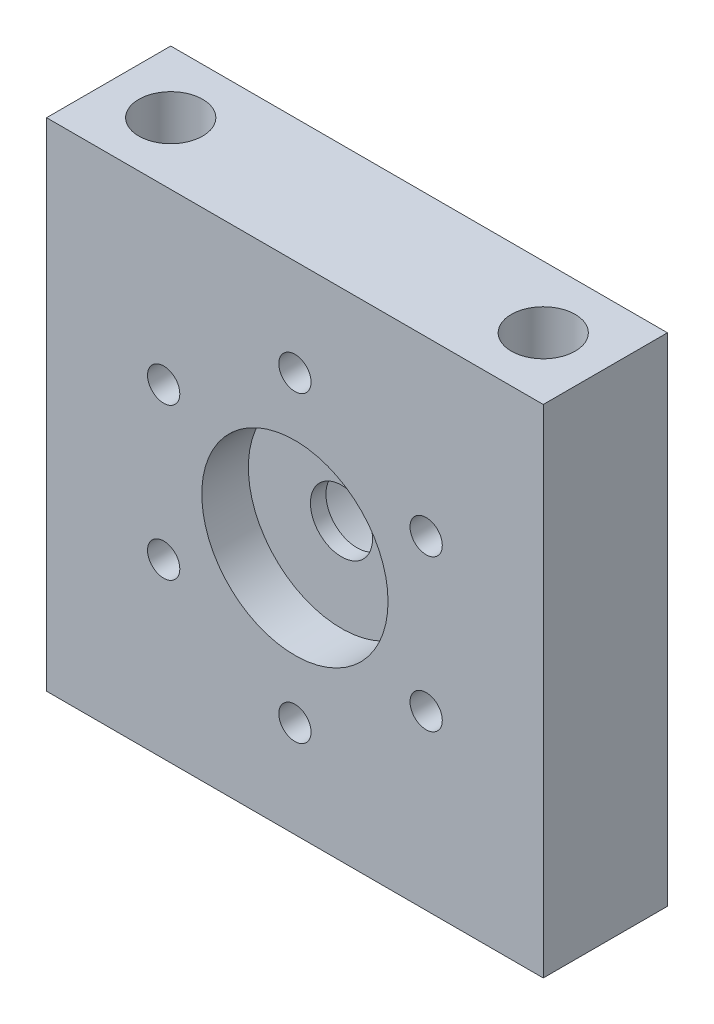
ISO-10303-21;
HEADER;
FILE_DESCRIPTION(('STEP AP214'),'2;1');
FILE_NAME('part.step','',(''),(''),'','','');
FILE_SCHEMA(('AUTOMOTIVE_DESIGN { 1 0 10303 214 1 1 1 1 }'));
ENDSEC;
DATA;
#1=APPLICATION_CONTEXT('core data for automotive mechanical design processes');
#2=APPLICATION_PROTOCOL_DEFINITION('international standard','automotive_design',2000,#1);
#3=PRODUCT_CONTEXT('',#1,'mechanical');
#4=PRODUCT('Part','Part','',(#3));
#5=PRODUCT_RELATED_PRODUCT_CATEGORY('part','',(#4));
#6=PRODUCT_DEFINITION_FORMATION('','',#4);
#7=PRODUCT_DEFINITION_CONTEXT('part definition',#1,'design');
#8=PRODUCT_DEFINITION('design','',#6,#7);
#9=PRODUCT_DEFINITION_SHAPE('','',#8);
#10=(LENGTH_UNIT() NAMED_UNIT(*) SI_UNIT(.MILLI.,.METRE.));
#11=(NAMED_UNIT(*) PLANE_ANGLE_UNIT() SI_UNIT($,.RADIAN.));
#12=(NAMED_UNIT(*) SI_UNIT($,.STERADIAN.) SOLID_ANGLE_UNIT());
#13=UNCERTAINTY_MEASURE_WITH_UNIT(LENGTH_MEASURE(1.E-05),#10,'distance_accuracy_value','');
#14=(GEOMETRIC_REPRESENTATION_CONTEXT(3) GLOBAL_UNCERTAINTY_ASSIGNED_CONTEXT((#13)) GLOBAL_UNIT_ASSIGNED_CONTEXT((#10,
#11,#12)) REPRESENTATION_CONTEXT('',''));
#15=CARTESIAN_POINT('',(0.,0.,0.));
#16=DIRECTION('',(0.,0.,1.));
#17=DIRECTION('',(1.,0.,0.));
#18=AXIS2_PLACEMENT_3D('',#15,#16,#17);
#19=CARTESIAN_POINT('',(25.4,25.4,-12.7));
#20=DIRECTION('',(0.,0.,1.));
#21=DIRECTION('',(1.,0.,0.));
#22=AXIS2_PLACEMENT_3D('',#19,#20,#21);
#23=CYLINDRICAL_SURFACE('',#22,3.175);
#24=CARTESIAN_POINT('',(25.4,25.4,-4.7625));
#25=DIRECTION('',(0.,0.,1.));
#26=DIRECTION('',(1.,0.,0.));
#27=AXIS2_PLACEMENT_3D('',#24,#25,#26);
#28=CIRCLE('',#27,3.175);
#29=CARTESIAN_POINT('',(28.575,25.4,-4.7625));
#30=VERTEX_POINT('',#29);
#31=EDGE_CURVE('E107',#30,#30,#28,.F.);
#32=ORIENTED_EDGE('',*,*,#31,.F.);
#33=EDGE_LOOP('',(#32));
#34=FACE_BOUND('',#33,.T.);
#35=CARTESIAN_POINT('',(25.4,25.4,-6.35));
#36=DIRECTION('',(0.,0.,-1.));
#37=DIRECTION('',(-1.,0.,0.));
#38=AXIS2_PLACEMENT_3D('',#35,#36,#37);
#39=CIRCLE('',#38,3.175);
#40=CARTESIAN_POINT('',(22.225,25.4,-6.35));
#41=VERTEX_POINT('',#40);
#42=EDGE_CURVE('E41',#41,#41,#39,.F.);
#43=ORIENTED_EDGE('',*,*,#42,.F.);
#44=EDGE_LOOP('',(#43));
#45=FACE_BOUND('',#44,.T.);
#46=ADVANCED_FACE('F37',(#34,#45),#23,.F.);
#47=CARTESIAN_POINT('',(0.,50.8,0.));
#48=DIRECTION('',(1.,0.,0.));
#49=DIRECTION('',(0.,0.,-1.));
#50=AXIS2_PLACEMENT_3D('',#47,#48,#49);
#51=PLANE('',#50);
#52=DIRECTION('',(0.,0.,1.));
#53=VECTOR('',#52,1.);
#54=CARTESIAN_POINT('',(0.,0.,0.));
#55=LINE('',#54,#53);
#56=CARTESIAN_POINT('',(0.,0.,-12.7));
#57=VERTEX_POINT('',#56);
#58=CARTESIAN_POINT('',(0.,0.,0.));
#59=VERTEX_POINT('',#58);
#60=EDGE_CURVE('E104',#57,#59,#55,.T.);
#61=ORIENTED_EDGE('',*,*,#60,.T.);
#62=DIRECTION('',(0.,-1.,0.));
#63=VECTOR('',#62,1.);
#64=CARTESIAN_POINT('',(0.,50.8,0.));
#65=LINE('',#64,#63);
#66=CARTESIAN_POINT('',(0.,50.8,0.));
#67=VERTEX_POINT('',#66);
#68=EDGE_CURVE('E11',#67,#59,#65,.T.);
#69=ORIENTED_EDGE('',*,*,#68,.F.);
#70=DIRECTION('',(0.,0.,1.));
#71=VECTOR('',#70,1.);
#72=CARTESIAN_POINT('',(0.,50.8,0.));
#73=LINE('',#72,#71);
#74=CARTESIAN_POINT('',(0.,50.8,-12.7));
#75=VERTEX_POINT('',#74);
#76=EDGE_CURVE('E91',#75,#67,#73,.T.);
#77=ORIENTED_EDGE('',*,*,#76,.F.);
#78=DIRECTION('',(0.,-1.,0.));
#79=VECTOR('',#78,1.);
#80=CARTESIAN_POINT('',(0.,50.8,-12.7));
#81=LINE('',#80,#79);
#82=EDGE_CURVE('E100',#75,#57,#81,.T.);
#83=ORIENTED_EDGE('',*,*,#82,.T.);
#84=EDGE_LOOP('',(#61,#69,#77,#83));
#85=FACE_BOUND('',#84,.T.);
#86=ADVANCED_FACE('F39',(#85),#51,.F.);
#87=CARTESIAN_POINT('',(0.,50.8,0.));
#88=DIRECTION('',(0.,0.,-1.));
#89=DIRECTION('',(-1.,0.,0.));
#90=AXIS2_PLACEMENT_3D('',#87,#88,#89);
#91=PLANE('',#90);
#92=CARTESIAN_POINT('',(25.4,40.9,0.));
#93=DIRECTION('',(0.,0.,1.));
#94=DIRECTION('',(1.,0.,0.));
#95=AXIS2_PLACEMENT_3D('',#92,#93,#94);
#96=CIRCLE('',#95,1.65);
#97=CARTESIAN_POINT('',(27.05,40.9,0.));
#98=VERTEX_POINT('',#97);
#99=EDGE_CURVE('E174',#98,#98,#96,.T.);
#100=ORIENTED_EDGE('',*,*,#99,.F.);
#101=EDGE_LOOP('',(#100));
#102=FACE_BOUND('',#101,.T.);
#103=CARTESIAN_POINT('',(11.9766062413417,33.1499999999994,0.));
#104=DIRECTION('',(0.,0.,1.));
#105=DIRECTION('',(1.,0.,0.));
#106=AXIS2_PLACEMENT_3D('',#103,#104,#105);
#107=CIRCLE('',#106,1.65);
#108=CARTESIAN_POINT('',(13.6266062413417,33.1499999999994,0.));
#109=VERTEX_POINT('',#108);
#110=EDGE_CURVE('E153',#109,#109,#107,.T.);
#111=ORIENTED_EDGE('',*,*,#110,.F.);
#112=EDGE_LOOP('',(#111));
#113=FACE_BOUND('',#112,.T.);
#114=CARTESIAN_POINT('',(11.9766062413424,17.6499999999994,0.));
#115=DIRECTION('',(0.,0.,1.));
#116=DIRECTION('',(1.,0.,0.));
#117=AXIS2_PLACEMENT_3D('',#114,#115,#116);
#118=CIRCLE('',#117,1.65);
#119=CARTESIAN_POINT('',(13.6266062413424,17.6499999999994,0.));
#120=VERTEX_POINT('',#119);
#121=EDGE_CURVE('E152',#120,#120,#118,.T.);
#122=ORIENTED_EDGE('',*,*,#121,.F.);
#123=EDGE_LOOP('',(#122));
#124=FACE_BOUND('',#123,.T.);
#125=CARTESIAN_POINT('',(25.4000000000017,9.9,0.));
#126=DIRECTION('',(0.,0.,1.));
#127=DIRECTION('',(1.,0.,0.));
#128=AXIS2_PLACEMENT_3D('',#125,#126,#127);
#129=CIRCLE('',#128,1.65);
#130=CARTESIAN_POINT('',(27.0500000000017,9.9,0.));
#131=VERTEX_POINT('',#130);
#132=EDGE_CURVE('E159',#131,#131,#129,.T.);
#133=ORIENTED_EDGE('',*,*,#132,.F.);
#134=EDGE_LOOP('',(#133));
#135=FACE_BOUND('',#134,.T.);
#136=CARTESIAN_POINT('',(38.8233937586601,17.6500000000007,0.));
#137=DIRECTION('',(0.,0.,1.));
#138=DIRECTION('',(1.,0.,0.));
#139=AXIS2_PLACEMENT_3D('',#136,#137,#138);
#140=CIRCLE('',#139,1.65);
#141=CARTESIAN_POINT('',(40.4733937586601,17.6500000000007,0.));
#142=VERTEX_POINT('',#141);
#143=EDGE_CURVE('E165',#142,#142,#140,.T.);
#144=ORIENTED_EDGE('',*,*,#143,.F.);
#145=EDGE_LOOP('',(#144));
#146=FACE_BOUND('',#145,.T.);
#147=CARTESIAN_POINT('',(38.8233937586593,33.1500000000007,0.));
#148=DIRECTION('',(0.,0.,1.));
#149=DIRECTION('',(1.,0.,0.));
#150=AXIS2_PLACEMENT_3D('',#147,#148,#149);
#151=CIRCLE('',#150,1.65);
#152=CARTESIAN_POINT('',(40.4733937586593,33.1500000000007,0.));
#153=VERTEX_POINT('',#152);
#154=EDGE_CURVE('E171',#153,#153,#151,.T.);
#155=ORIENTED_EDGE('',*,*,#154,.F.);
#156=EDGE_LOOP('',(#155));
#157=FACE_BOUND('',#156,.T.);
#158=CARTESIAN_POINT('',(25.4,25.4,0.));
#159=DIRECTION('',(0.,0.,1.));
#160=DIRECTION('',(1.,0.,0.));
#161=AXIS2_PLACEMENT_3D('',#158,#159,#160);
#162=CIRCLE('',#161,9.525);
#163=CARTESIAN_POINT('',(34.925,25.4,0.));
#164=VERTEX_POINT('',#163);
#165=EDGE_CURVE('E117',#164,#164,#162,.T.);
#166=ORIENTED_EDGE('',*,*,#165,.F.);
#167=EDGE_LOOP('',(#166));
#168=FACE_BOUND('',#167,.T.);
#169=DIRECTION('',(1.,0.,0.));
#170=VECTOR('',#169,1.);
#171=CARTESIAN_POINT('',(0.,0.,0.));
#172=LINE('',#171,#170);
#173=CARTESIAN_POINT('',(50.8,0.,0.));
#174=VERTEX_POINT('',#173);
#175=EDGE_CURVE('E95',#59,#174,#172,.T.);
#176=ORIENTED_EDGE('',*,*,#175,.T.);
#177=DIRECTION('',(0.,-1.,0.));
#178=VECTOR('',#177,1.);
#179=CARTESIAN_POINT('',(50.8,50.8,0.));
#180=LINE('',#179,#178);
#181=CARTESIAN_POINT('',(50.8,50.8,0.));
#182=VERTEX_POINT('',#181);
#183=EDGE_CURVE('E47',#182,#174,#180,.T.);
#184=ORIENTED_EDGE('',*,*,#183,.F.);
#185=DIRECTION('',(1.,0.,0.));
#186=VECTOR('',#185,1.);
#187=CARTESIAN_POINT('',(0.,50.8,0.));
#188=LINE('',#187,#186);
#189=EDGE_CURVE('E86',#67,#182,#188,.T.);
#190=ORIENTED_EDGE('',*,*,#189,.F.);
#191=ORIENTED_EDGE('',*,*,#68,.T.);
#192=EDGE_LOOP('',(#176,#184,#190,#191));
#193=FACE_BOUND('',#192,.T.);
#194=ADVANCED_FACE('F94',(#102,#113,#124,#135,#146,#157,#168,#193),#91,.F.);
#195=CARTESIAN_POINT('',(50.8,50.8,0.));
#196=DIRECTION('',(-1.,0.,0.));
#197=DIRECTION('',(0.,0.,1.));
#198=AXIS2_PLACEMENT_3D('',#195,#196,#197);
#199=PLANE('',#198);
#200=DIRECTION('',(0.,0.,-1.));
#201=VECTOR('',#200,1.);
#202=CARTESIAN_POINT('',(50.8,0.,0.));
#203=LINE('',#202,#201);
#204=CARTESIAN_POINT('',(50.8,0.,-12.7));
#205=VERTEX_POINT('',#204);
#206=EDGE_CURVE('E73',#174,#205,#203,.T.);
#207=ORIENTED_EDGE('',*,*,#206,.T.);
#208=DIRECTION('',(0.,-1.,0.));
#209=VECTOR('',#208,1.);
#210=CARTESIAN_POINT('',(50.8,50.8,-12.7));
#211=LINE('',#210,#209);
#212=CARTESIAN_POINT('',(50.8,50.8,-12.7));
#213=VERTEX_POINT('',#212);
#214=EDGE_CURVE('E96',#213,#205,#211,.T.);
#215=ORIENTED_EDGE('',*,*,#214,.F.);
#216=DIRECTION('',(0.,0.,-1.));
#217=VECTOR('',#216,1.);
#218=CARTESIAN_POINT('',(50.8,50.8,0.));
#219=LINE('',#218,#217);
#220=EDGE_CURVE('E89',#182,#213,#219,.T.);
#221=ORIENTED_EDGE('',*,*,#220,.F.);
#222=ORIENTED_EDGE('',*,*,#183,.T.);
#223=EDGE_LOOP('',(#207,#215,#221,#222));
#224=FACE_BOUND('',#223,.T.);
#225=ADVANCED_FACE('F98',(#224),#199,.F.);
#226=CARTESIAN_POINT('',(0.,50.8,-12.7));
#227=DIRECTION('',(0.,0.,1.));
#228=DIRECTION('',(1.,0.,0.));
#229=AXIS2_PLACEMENT_3D('',#226,#227,#228);
#230=PLANE('',#229);
#231=CARTESIAN_POINT('',(25.4,25.4,-12.7));
#232=DIRECTION('',(0.,0.,-1.));
#233=DIRECTION('',(-1.,0.,0.));
#234=AXIS2_PLACEMENT_3D('',#231,#232,#233);
#235=CIRCLE('',#234,7.62);
#236=CARTESIAN_POINT('',(17.78,25.4,-12.7));
#237=VERTEX_POINT('',#236);
#238=EDGE_CURVE('E184',#237,#237,#235,.T.);
#239=ORIENTED_EDGE('',*,*,#238,.F.);
#240=EDGE_LOOP('',(#239));
#241=FACE_BOUND('',#240,.T.);
#242=CARTESIAN_POINT('',(25.4,40.9,-12.7));
#243=DIRECTION('',(0.,0.,1.));
#244=DIRECTION('',(1.,0.,0.));
#245=AXIS2_PLACEMENT_3D('',#242,#243,#244);
#246=CIRCLE('',#245,1.65);
#247=CARTESIAN_POINT('',(27.05,40.9,-12.7));
#248=VERTEX_POINT('',#247);
#249=EDGE_CURVE('E141',#248,#248,#246,.T.);
#250=ORIENTED_EDGE('',*,*,#249,.T.);
#251=EDGE_LOOP('',(#250));
#252=FACE_BOUND('',#251,.T.);
#253=CARTESIAN_POINT('',(11.9766062413417,33.1499999999994,-12.7));
#254=DIRECTION('',(0.,0.,1.));
#255=DIRECTION('',(1.,0.,0.));
#256=AXIS2_PLACEMENT_3D('',#253,#254,#255);
#257=CIRCLE('',#256,1.65);
#258=CARTESIAN_POINT('',(13.6266062413417,33.1499999999994,-12.7));
#259=VERTEX_POINT('',#258);
#260=EDGE_CURVE('E175',#259,#259,#257,.T.);
#261=ORIENTED_EDGE('',*,*,#260,.T.);
#262=EDGE_LOOP('',(#261));
#263=FACE_BOUND('',#262,.T.);
#264=CARTESIAN_POINT('',(11.9766062413424,17.6499999999994,-12.7));
#265=DIRECTION('',(0.,0.,1.));
#266=DIRECTION('',(1.,0.,0.));
#267=AXIS2_PLACEMENT_3D('',#264,#265,#266);
#268=CIRCLE('',#267,1.65);
#269=CARTESIAN_POINT('',(13.6266062413424,17.6499999999994,-12.7));
#270=VERTEX_POINT('',#269);
#271=EDGE_CURVE('E149',#270,#270,#268,.T.);
#272=ORIENTED_EDGE('',*,*,#271,.T.);
#273=EDGE_LOOP('',(#272));
#274=FACE_BOUND('',#273,.T.);
#275=CARTESIAN_POINT('',(25.4000000000017,9.9,-12.7));
#276=DIRECTION('',(0.,0.,1.));
#277=DIRECTION('',(1.,0.,0.));
#278=AXIS2_PLACEMENT_3D('',#275,#276,#277);
#279=CIRCLE('',#278,1.65);
#280=CARTESIAN_POINT('',(27.0500000000017,9.9,-12.7));
#281=VERTEX_POINT('',#280);
#282=EDGE_CURVE('E156',#281,#281,#279,.T.);
#283=ORIENTED_EDGE('',*,*,#282,.T.);
#284=EDGE_LOOP('',(#283));
#285=FACE_BOUND('',#284,.T.);
#286=CARTESIAN_POINT('',(38.8233937586601,17.6500000000007,-12.7));
#287=DIRECTION('',(0.,0.,1.));
#288=DIRECTION('',(1.,0.,0.));
#289=AXIS2_PLACEMENT_3D('',#286,#287,#288);
#290=CIRCLE('',#289,1.65);
#291=CARTESIAN_POINT('',(40.4733937586601,17.6500000000007,-12.7));
#292=VERTEX_POINT('',#291);
#293=EDGE_CURVE('E162',#292,#292,#290,.T.);
#294=ORIENTED_EDGE('',*,*,#293,.T.);
#295=EDGE_LOOP('',(#294));
#296=FACE_BOUND('',#295,.T.);
#297=CARTESIAN_POINT('',(38.8233937586593,33.1500000000007,-12.7));
#298=DIRECTION('',(0.,0.,1.));
#299=DIRECTION('',(1.,0.,0.));
#300=AXIS2_PLACEMENT_3D('',#297,#298,#299);
#301=CIRCLE('',#300,1.65);
#302=CARTESIAN_POINT('',(40.4733937586593,33.1500000000007,-12.7));
#303=VERTEX_POINT('',#302);
#304=EDGE_CURVE('E168',#303,#303,#301,.T.);
#305=ORIENTED_EDGE('',*,*,#304,.T.);
#306=EDGE_LOOP('',(#305));
#307=FACE_BOUND('',#306,.T.);
#308=DIRECTION('',(-1.,0.,0.));
#309=VECTOR('',#308,1.);
#310=CARTESIAN_POINT('',(0.,0.,-12.7));
#311=LINE('',#310,#309);
#312=EDGE_CURVE('E79',#205,#57,#311,.T.);
#313=ORIENTED_EDGE('',*,*,#312,.T.);
#314=ORIENTED_EDGE('',*,*,#82,.F.);
#315=DIRECTION('',(-1.,0.,0.));
#316=VECTOR('',#315,1.);
#317=CARTESIAN_POINT('',(0.,50.8,-12.7));
#318=LINE('',#317,#316);
#319=EDGE_CURVE('E56',#213,#75,#318,.T.);
#320=ORIENTED_EDGE('',*,*,#319,.F.);
#321=ORIENTED_EDGE('',*,*,#214,.T.);
#322=EDGE_LOOP('',(#313,#314,#320,#321));
#323=FACE_BOUND('',#322,.T.);
#324=ADVANCED_FACE('F210',(#241,#252,#263,#274,#285,#296,#307,#323),#230,.F.);
#325=CARTESIAN_POINT('',(0.,50.8,0.));
#326=DIRECTION('',(0.,-1.,0.));
#327=DIRECTION('',(0.,0.,-1.));
#328=AXIS2_PLACEMENT_3D('',#325,#326,#327);
#329=PLANE('',#328);
#330=CARTESIAN_POINT('',(6.35,50.8,-6.35));
#331=DIRECTION('',(0.,1.,0.));
#332=DIRECTION('',(0.,0.,1.));
#333=AXIS2_PLACEMENT_3D('',#330,#331,#332);
#334=CIRCLE('',#333,3.2639);
#335=CARTESIAN_POINT('',(6.35,50.8,-3.08609999999999));
#336=VERTEX_POINT('',#335);
#337=EDGE_CURVE('E132',#336,#336,#334,.T.);
#338=ORIENTED_EDGE('',*,*,#337,.F.);
#339=EDGE_LOOP('',(#338));
#340=FACE_BOUND('',#339,.T.);
#341=CARTESIAN_POINT('',(44.45,50.8,-6.35));
#342=DIRECTION('',(0.,1.,0.));
#343=DIRECTION('',(0.,0.,1.));
#344=AXIS2_PLACEMENT_3D('',#341,#342,#343);
#345=CIRCLE('',#344,3.26389999999999);
#346=CARTESIAN_POINT('',(44.45,50.8,-3.08610000000001));
#347=VERTEX_POINT('',#346);
#348=EDGE_CURVE('E128',#347,#347,#345,.T.);
#349=ORIENTED_EDGE('',*,*,#348,.F.);
#350=EDGE_LOOP('',(#349));
#351=FACE_BOUND('',#350,.T.);
#352=ORIENTED_EDGE('',*,*,#76,.T.);
#353=ORIENTED_EDGE('',*,*,#189,.T.);
#354=ORIENTED_EDGE('',*,*,#220,.T.);
#355=ORIENTED_EDGE('',*,*,#319,.T.);
#356=EDGE_LOOP('',(#352,#353,#354,#355));
#357=FACE_BOUND('',#356,.T.);
#358=ADVANCED_FACE('F87',(#340,#351,#357),#329,.F.);
#359=CARTESIAN_POINT('',(0.,0.,0.));
#360=DIRECTION('',(0.,-1.,0.));
#361=DIRECTION('',(0.,0.,-1.));
#362=AXIS2_PLACEMENT_3D('',#359,#360,#361);
#363=PLANE('',#362);
#364=CARTESIAN_POINT('',(6.35,0.,-6.35));
#365=DIRECTION('',(0.,1.,0.));
#366=DIRECTION('',(0.,0.,1.));
#367=AXIS2_PLACEMENT_3D('',#364,#365,#366);
#368=CIRCLE('',#367,3.2639);
#369=CARTESIAN_POINT('',(6.35,0.,-3.08609999999999));
#370=VERTEX_POINT('',#369);
#371=EDGE_CURVE('E144',#370,#370,#368,.T.);
#372=ORIENTED_EDGE('',*,*,#371,.T.);
#373=EDGE_LOOP('',(#372));
#374=FACE_BOUND('',#373,.T.);
#375=CARTESIAN_POINT('',(44.45,0.,-6.35));
#376=DIRECTION('',(0.,1.,0.));
#377=DIRECTION('',(0.,0.,1.));
#378=AXIS2_PLACEMENT_3D('',#375,#376,#377);
#379=CIRCLE('',#378,3.26389999999999);
#380=CARTESIAN_POINT('',(44.45,0.,-3.08610000000001));
#381=VERTEX_POINT('',#380);
#382=EDGE_CURVE('E137',#381,#381,#379,.T.);
#383=ORIENTED_EDGE('',*,*,#382,.T.);
#384=EDGE_LOOP('',(#383));
#385=FACE_BOUND('',#384,.T.);
#386=ORIENTED_EDGE('',*,*,#60,.F.);
#387=ORIENTED_EDGE('',*,*,#312,.F.);
#388=ORIENTED_EDGE('',*,*,#206,.F.);
#389=ORIENTED_EDGE('',*,*,#175,.F.);
#390=EDGE_LOOP('',(#386,#387,#388,#389));
#391=FACE_BOUND('',#390,.T.);
#392=ADVANCED_FACE('F209',(#374,#385,#391),#363,.T.);
#393=CARTESIAN_POINT('',(25.4,25.4,-4.7625));
#394=DIRECTION('',(0.,0.,1.));
#395=DIRECTION('',(1.,0.,0.));
#396=AXIS2_PLACEMENT_3D('',#393,#394,#395);
#397=PLANE('',#396);
#398=CARTESIAN_POINT('',(25.4,25.4,-4.7625));
#399=DIRECTION('',(0.,0.,1.));
#400=DIRECTION('',(1.,0.,0.));
#401=AXIS2_PLACEMENT_3D('',#398,#399,#400);
#402=CIRCLE('',#401,9.525);
#403=CARTESIAN_POINT('',(34.925,25.4,-4.7625));
#404=VERTEX_POINT('',#403);
#405=EDGE_CURVE('E113',#404,#404,#402,.T.);
#406=ORIENTED_EDGE('',*,*,#405,.T.);
#407=EDGE_LOOP('',(#406));
#408=FACE_BOUND('',#407,.T.);
#409=ORIENTED_EDGE('',*,*,#31,.T.);
#410=EDGE_LOOP('',(#409));
#411=FACE_BOUND('',#410,.T.);
#412=ADVANCED_FACE('F214',(#408,#411),#397,.T.);
#413=CARTESIAN_POINT('',(25.4,25.4,-4.7625));
#414=DIRECTION('',(0.,0.,1.));
#415=DIRECTION('',(1.,0.,0.));
#416=AXIS2_PLACEMENT_3D('',#413,#414,#415);
#417=CYLINDRICAL_SURFACE('',#416,9.525);
#418=ORIENTED_EDGE('',*,*,#405,.F.);
#419=EDGE_LOOP('',(#418));
#420=FACE_BOUND('',#419,.T.);
#421=ORIENTED_EDGE('',*,*,#165,.T.);
#422=EDGE_LOOP('',(#421));
#423=FACE_BOUND('',#422,.T.);
#424=ADVANCED_FACE('F205',(#420,#423),#417,.F.);
#425=CARTESIAN_POINT('',(44.45,38.1,-6.35));
#426=DIRECTION('',(0.,1.,0.));
#427=DIRECTION('',(0.,0.,1.));
#428=AXIS2_PLACEMENT_3D('',#425,#426,#427);
#429=CYLINDRICAL_SURFACE('',#428,3.26389999999999);
#430=CARTESIAN_POINT('',(44.45,38.1,-6.35));
#431=DIRECTION('',(0.,1.,0.));
#432=DIRECTION('',(0.,0.,1.));
#433=AXIS2_PLACEMENT_3D('',#430,#431,#432);
#434=CIRCLE('',#433,3.26389999999999);
#435=CARTESIAN_POINT('',(44.45,38.1,-3.08610000000001));
#436=VERTEX_POINT('',#435);
#437=EDGE_CURVE('E125',#436,#436,#434,.T.);
#438=ORIENTED_EDGE('',*,*,#437,.F.);
#439=EDGE_LOOP('',(#438));
#440=FACE_BOUND('',#439,.T.);
#441=ORIENTED_EDGE('',*,*,#348,.T.);
#442=EDGE_LOOP('',(#441));
#443=FACE_BOUND('',#442,.T.);
#444=ADVANCED_FACE('F239',(#440,#443),#429,.F.);
#445=CARTESIAN_POINT('',(44.45,38.1,-6.35));
#446=DIRECTION('',(0.,1.,0.));
#447=DIRECTION('',(0.,0.,1.));
#448=AXIS2_PLACEMENT_3D('',#445,#446,#447);
#449=PLANE('',#448);
#450=ORIENTED_EDGE('',*,*,#437,.T.);
#451=EDGE_LOOP('',(#450));
#452=FACE_BOUND('',#451,.T.);
#453=ADVANCED_FACE('F245',(#452),#449,.T.);
#454=CARTESIAN_POINT('',(6.35,38.1,-6.35));
#455=DIRECTION('',(0.,1.,0.));
#456=DIRECTION('',(0.,0.,1.));
#457=AXIS2_PLACEMENT_3D('',#454,#455,#456);
#458=CYLINDRICAL_SURFACE('',#457,3.2639);
#459=CARTESIAN_POINT('',(6.35,38.1,-6.35));
#460=DIRECTION('',(0.,1.,0.));
#461=DIRECTION('',(0.,0.,1.));
#462=AXIS2_PLACEMENT_3D('',#459,#460,#461);
#463=CIRCLE('',#462,3.2639);
#464=CARTESIAN_POINT('',(6.35,38.1,-3.08609999999999));
#465=VERTEX_POINT('',#464);
#466=EDGE_CURVE('E122',#465,#465,#463,.T.);
#467=ORIENTED_EDGE('',*,*,#466,.F.);
#468=EDGE_LOOP('',(#467));
#469=FACE_BOUND('',#468,.T.);
#470=ORIENTED_EDGE('',*,*,#337,.T.);
#471=EDGE_LOOP('',(#470));
#472=FACE_BOUND('',#471,.T.);
#473=ADVANCED_FACE('F252',(#469,#472),#458,.F.);
#474=CARTESIAN_POINT('',(6.35,38.1,-6.35));
#475=DIRECTION('',(0.,1.,0.));
#476=DIRECTION('',(0.,0.,1.));
#477=AXIS2_PLACEMENT_3D('',#474,#475,#476);
#478=PLANE('',#477);
#479=ORIENTED_EDGE('',*,*,#466,.T.);
#480=EDGE_LOOP('',(#479));
#481=FACE_BOUND('',#480,.T.);
#482=ADVANCED_FACE('F257',(#481),#478,.T.);
#483=CARTESIAN_POINT('',(44.45,12.7,-6.35));
#484=DIRECTION('',(0.,-1.,0.));
#485=DIRECTION('',(0.,0.,-1.));
#486=AXIS2_PLACEMENT_3D('',#483,#484,#485);
#487=CYLINDRICAL_SURFACE('',#486,3.26389999999999);
#488=CARTESIAN_POINT('',(44.45,12.7,-6.35));
#489=DIRECTION('',(0.,1.,0.));
#490=DIRECTION('',(0.,0.,1.));
#491=AXIS2_PLACEMENT_3D('',#488,#489,#490);
#492=CIRCLE('',#491,3.26389999999999);
#493=CARTESIAN_POINT('',(44.45,12.7,-3.08610000000001));
#494=VERTEX_POINT('',#493);
#495=EDGE_CURVE('E140',#494,#494,#492,.T.);
#496=ORIENTED_EDGE('',*,*,#495,.T.);
#497=EDGE_LOOP('',(#496));
#498=FACE_BOUND('',#497,.T.);
#499=ORIENTED_EDGE('',*,*,#382,.F.);
#500=EDGE_LOOP('',(#499));
#501=FACE_BOUND('',#500,.T.);
#502=ADVANCED_FACE('F261',(#498,#501),#487,.F.);
#503=CARTESIAN_POINT('',(44.45,12.7,-6.35));
#504=DIRECTION('',(0.,-1.,0.));
#505=DIRECTION('',(0.,0.,1.));
#506=AXIS2_PLACEMENT_3D('',#503,#504,#505);
#507=PLANE('',#506);
#508=ORIENTED_EDGE('',*,*,#495,.F.);
#509=EDGE_LOOP('',(#508));
#510=FACE_BOUND('',#509,.T.);
#511=ADVANCED_FACE('F265',(#510),#507,.T.);
#512=CARTESIAN_POINT('',(6.35,12.7,-6.35));
#513=DIRECTION('',(0.,-1.,0.));
#514=DIRECTION('',(0.,0.,-1.));
#515=AXIS2_PLACEMENT_3D('',#512,#513,#514);
#516=CYLINDRICAL_SURFACE('',#515,3.2639);
#517=CARTESIAN_POINT('',(6.35,12.7,-6.35));
#518=DIRECTION('',(0.,1.,0.));
#519=DIRECTION('',(0.,0.,1.));
#520=AXIS2_PLACEMENT_3D('',#517,#518,#519);
#521=CIRCLE('',#520,3.2639);
#522=CARTESIAN_POINT('',(6.35,12.7,-3.08609999999999));
#523=VERTEX_POINT('',#522);
#524=EDGE_CURVE('E129',#523,#523,#521,.T.);
#525=ORIENTED_EDGE('',*,*,#524,.T.);
#526=EDGE_LOOP('',(#525));
#527=FACE_BOUND('',#526,.T.);
#528=ORIENTED_EDGE('',*,*,#371,.F.);
#529=EDGE_LOOP('',(#528));
#530=FACE_BOUND('',#529,.T.);
#531=ADVANCED_FACE('F269',(#527,#530),#516,.F.);
#532=CARTESIAN_POINT('',(6.35,12.7,-6.35));
#533=DIRECTION('',(0.,-1.,0.));
#534=DIRECTION('',(0.,0.,1.));
#535=AXIS2_PLACEMENT_3D('',#532,#533,#534);
#536=PLANE('',#535);
#537=ORIENTED_EDGE('',*,*,#524,.F.);
#538=EDGE_LOOP('',(#537));
#539=FACE_BOUND('',#538,.T.);
#540=ADVANCED_FACE('F273',(#539),#536,.T.);
#541=CARTESIAN_POINT('',(38.8233937586593,33.1500000000007,-12.7));
#542=DIRECTION('',(0.,0.,1.));
#543=DIRECTION('',(1.,0.,0.));
#544=AXIS2_PLACEMENT_3D('',#541,#542,#543);
#545=CYLINDRICAL_SURFACE('',#544,1.65);
#546=ORIENTED_EDGE('',*,*,#304,.F.);
#547=EDGE_LOOP('',(#546));
#548=FACE_BOUND('',#547,.T.);
#549=ORIENTED_EDGE('',*,*,#154,.T.);
#550=EDGE_LOOP('',(#549));
#551=FACE_BOUND('',#550,.T.);
#552=ADVANCED_FACE('F277',(#548,#551),#545,.F.);
#553=CARTESIAN_POINT('',(38.8233937586601,17.6500000000007,-12.7));
#554=DIRECTION('',(0.,0.,1.));
#555=DIRECTION('',(1.,0.,0.));
#556=AXIS2_PLACEMENT_3D('',#553,#554,#555);
#557=CYLINDRICAL_SURFACE('',#556,1.65);
#558=ORIENTED_EDGE('',*,*,#293,.F.);
#559=EDGE_LOOP('',(#558));
#560=FACE_BOUND('',#559,.T.);
#561=ORIENTED_EDGE('',*,*,#143,.T.);
#562=EDGE_LOOP('',(#561));
#563=FACE_BOUND('',#562,.T.);
#564=ADVANCED_FACE('F287',(#560,#563),#557,.F.);
#565=CARTESIAN_POINT('',(25.4000000000017,9.9,-12.7));
#566=DIRECTION('',(0.,0.,1.));
#567=DIRECTION('',(1.,0.,0.));
#568=AXIS2_PLACEMENT_3D('',#565,#566,#567);
#569=CYLINDRICAL_SURFACE('',#568,1.65);
#570=ORIENTED_EDGE('',*,*,#282,.F.);
#571=EDGE_LOOP('',(#570));
#572=FACE_BOUND('',#571,.T.);
#573=ORIENTED_EDGE('',*,*,#132,.T.);
#574=EDGE_LOOP('',(#573));
#575=FACE_BOUND('',#574,.T.);
#576=ADVANCED_FACE('F283',(#572,#575),#569,.F.);
#577=CARTESIAN_POINT('',(11.9766062413424,17.6499999999994,-12.7));
#578=DIRECTION('',(0.,0.,1.));
#579=DIRECTION('',(1.,0.,0.));
#580=AXIS2_PLACEMENT_3D('',#577,#578,#579);
#581=CYLINDRICAL_SURFACE('',#580,1.65);
#582=ORIENTED_EDGE('',*,*,#271,.F.);
#583=EDGE_LOOP('',(#582));
#584=FACE_BOUND('',#583,.T.);
#585=ORIENTED_EDGE('',*,*,#121,.T.);
#586=EDGE_LOOP('',(#585));
#587=FACE_BOUND('',#586,.T.);
#588=ADVANCED_FACE('F279',(#584,#587),#581,.F.);
#589=CARTESIAN_POINT('',(11.9766062413417,33.1499999999994,-12.7));
#590=DIRECTION('',(0.,0.,1.));
#591=DIRECTION('',(1.,0.,0.));
#592=AXIS2_PLACEMENT_3D('',#589,#590,#591);
#593=CYLINDRICAL_SURFACE('',#592,1.65);
#594=ORIENTED_EDGE('',*,*,#260,.F.);
#595=EDGE_LOOP('',(#594));
#596=FACE_BOUND('',#595,.T.);
#597=ORIENTED_EDGE('',*,*,#110,.T.);
#598=EDGE_LOOP('',(#597));
#599=FACE_BOUND('',#598,.T.);
#600=ADVANCED_FACE('F282',(#596,#599),#593,.F.);
#601=CARTESIAN_POINT('',(25.4,40.9,-12.7));
#602=DIRECTION('',(0.,0.,1.));
#603=DIRECTION('',(1.,0.,0.));
#604=AXIS2_PLACEMENT_3D('',#601,#602,#603);
#605=CYLINDRICAL_SURFACE('',#604,1.65);
#606=ORIENTED_EDGE('',*,*,#249,.F.);
#607=EDGE_LOOP('',(#606));
#608=FACE_BOUND('',#607,.T.);
#609=ORIENTED_EDGE('',*,*,#99,.T.);
#610=EDGE_LOOP('',(#609));
#611=FACE_BOUND('',#610,.T.);
#612=ADVANCED_FACE('F297',(#608,#611),#605,.F.);
#613=CARTESIAN_POINT('',(25.4,25.4,-6.35));
#614=DIRECTION('',(0.,0.,-1.));
#615=DIRECTION('',(-1.,0.,0.));
#616=AXIS2_PLACEMENT_3D('',#613,#614,#615);
#617=PLANE('',#616);
#618=CARTESIAN_POINT('',(25.4,25.4,-6.35));
#619=DIRECTION('',(0.,0.,-1.));
#620=DIRECTION('',(-1.,0.,0.));
#621=AXIS2_PLACEMENT_3D('',#618,#619,#620);
#622=CIRCLE('',#621,7.62);
#623=CARTESIAN_POINT('',(17.78,25.4,-6.35));
#624=VERTEX_POINT('',#623);
#625=EDGE_CURVE('E187',#624,#624,#622,.T.);
#626=ORIENTED_EDGE('',*,*,#625,.T.);
#627=EDGE_LOOP('',(#626));
#628=FACE_BOUND('',#627,.T.);
#629=ORIENTED_EDGE('',*,*,#42,.T.);
#630=EDGE_LOOP('',(#629));
#631=FACE_BOUND('',#630,.T.);
#632=ADVANCED_FACE('F194',(#628,#631),#617,.T.);
#633=CARTESIAN_POINT('',(25.4,25.4,-6.35));
#634=DIRECTION('',(0.,0.,-1.));
#635=DIRECTION('',(-1.,0.,0.));
#636=AXIS2_PLACEMENT_3D('',#633,#634,#635);
#637=CYLINDRICAL_SURFACE('',#636,7.62);
#638=ORIENTED_EDGE('',*,*,#625,.F.);
#639=EDGE_LOOP('',(#638));
#640=FACE_BOUND('',#639,.T.);
#641=ORIENTED_EDGE('',*,*,#238,.T.);
#642=EDGE_LOOP('',(#641));
#643=FACE_BOUND('',#642,.T.);
#644=ADVANCED_FACE('F302',(#640,#643),#637,.F.);
#645=CLOSED_SHELL('',(#46,#86,#194,#225,#324,#358,#392,#412,#424,#444,#453,#473,#482,#502,#511,
#531,#540,#552,#564,#576,#588,#600,#612,#632,#644));
#646=MANIFOLD_SOLID_BREP('B2',#645);
#647=ADVANCED_BREP_SHAPE_REPRESENTATION('',(#18,#646),#14);
#648=SHAPE_DEFINITION_REPRESENTATION(#9,#647);
ENDSEC;
END-ISO-10303-21;
